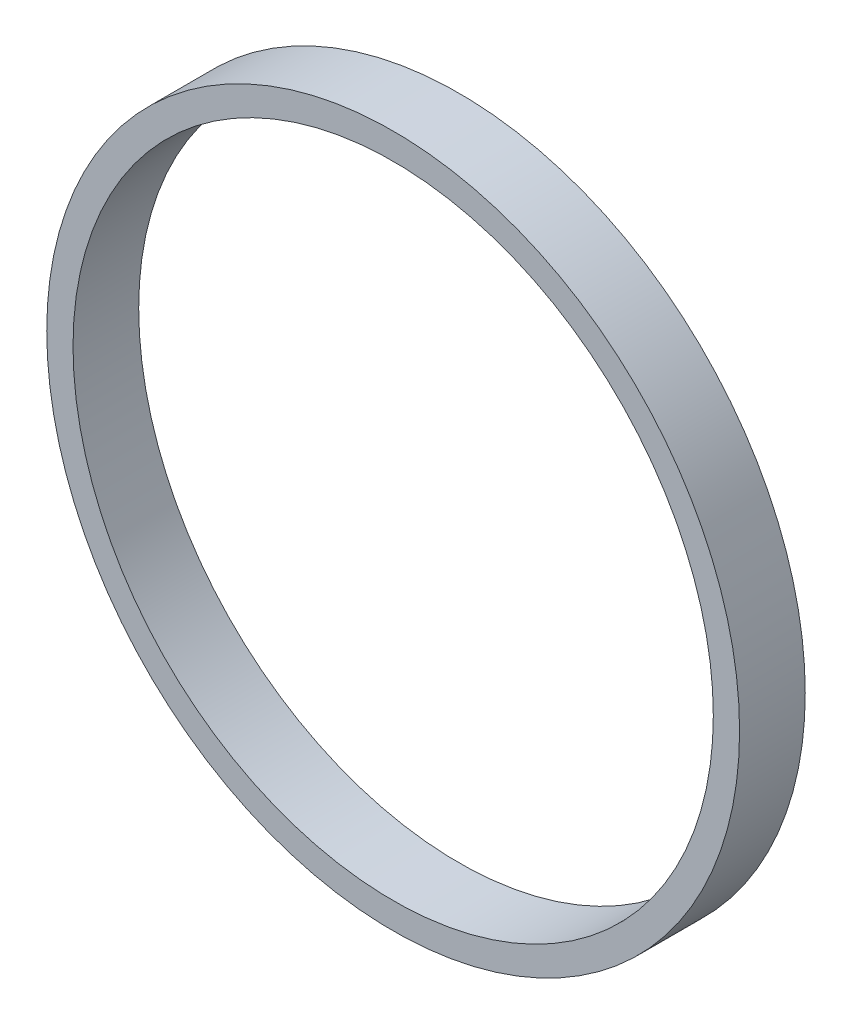
ISO-10303-21;
HEADER;
FILE_DESCRIPTION(('STEP AP214'),'2;1');
FILE_NAME('part.step','',(''),(''),'','','');
FILE_SCHEMA(('AUTOMOTIVE_DESIGN { 1 0 10303 214 1 1 1 1 }'));
ENDSEC;
DATA;
#1=APPLICATION_CONTEXT('core data for automotive mechanical design processes');
#2=APPLICATION_PROTOCOL_DEFINITION('international standard','automotive_design',2000,#1);
#3=PRODUCT_CONTEXT('',#1,'mechanical');
#4=PRODUCT('Part','Part','',(#3));
#5=PRODUCT_RELATED_PRODUCT_CATEGORY('part','',(#4));
#6=PRODUCT_DEFINITION_FORMATION('','',#4);
#7=PRODUCT_DEFINITION_CONTEXT('part definition',#1,'design');
#8=PRODUCT_DEFINITION('design','',#6,#7);
#9=PRODUCT_DEFINITION_SHAPE('','',#8);
#10=(LENGTH_UNIT() NAMED_UNIT(*) SI_UNIT(.MILLI.,.METRE.));
#11=(NAMED_UNIT(*) PLANE_ANGLE_UNIT() SI_UNIT($,.RADIAN.));
#12=(NAMED_UNIT(*) SI_UNIT($,.STERADIAN.) SOLID_ANGLE_UNIT());
#13=UNCERTAINTY_MEASURE_WITH_UNIT(LENGTH_MEASURE(1.E-05),#10,'distance_accuracy_value','');
#14=(GEOMETRIC_REPRESENTATION_CONTEXT(3) GLOBAL_UNCERTAINTY_ASSIGNED_CONTEXT((#13)) GLOBAL_UNIT_ASSIGNED_CONTEXT((#10,
#11,#12)) REPRESENTATION_CONTEXT('',''));
#15=CARTESIAN_POINT('',(0.,0.,0.));
#16=DIRECTION('',(0.,0.,1.));
#17=DIRECTION('',(1.,0.,0.));
#18=AXIS2_PLACEMENT_3D('',#15,#16,#17);
#19=CARTESIAN_POINT('',(0.,0.,10.));
#20=DIRECTION('',(0.,0.,1.));
#21=DIRECTION('',(1.,0.,0.));
#22=AXIS2_PLACEMENT_3D('',#19,#20,#21);
#23=PLANE('',#22);
#24=CARTESIAN_POINT('',(0.,0.,10.));
#25=DIRECTION('',(0.,0.,1.));
#26=DIRECTION('',(1.,0.,0.));
#27=AXIS2_PLACEMENT_3D('',#24,#25,#26);
#28=CIRCLE('',#27,52.75);
#29=CARTESIAN_POINT('',(52.75,0.,10.));
#30=VERTEX_POINT('',#29);
#31=EDGE_CURVE('E11',#30,#30,#28,.T.);
#32=ORIENTED_EDGE('',*,*,#31,.T.);
#33=EDGE_LOOP('',(#32));
#34=FACE_BOUND('',#33,.T.);
#35=CARTESIAN_POINT('',(0.,0.,10.));
#36=DIRECTION('',(0.,0.,1.));
#37=DIRECTION('',(1.,0.,0.));
#38=AXIS2_PLACEMENT_3D('',#35,#36,#37);
#39=CIRCLE('',#38,48.75);
#40=CARTESIAN_POINT('',(48.75,0.,10.));
#41=VERTEX_POINT('',#40);
#42=EDGE_CURVE('E52',#41,#41,#39,.T.);
#43=ORIENTED_EDGE('',*,*,#42,.F.);
#44=EDGE_LOOP('',(#43));
#45=FACE_BOUND('',#44,.T.);
#46=ADVANCED_FACE('F41',(#34,#45),#23,.T.);
#47=CARTESIAN_POINT('',(0.,0.,0.));
#48=DIRECTION('',(0.,0.,1.));
#49=DIRECTION('',(1.,0.,0.));
#50=AXIS2_PLACEMENT_3D('',#47,#48,#49);
#51=PLANE('',#50);
#52=CARTESIAN_POINT('',(0.,0.,0.));
#53=DIRECTION('',(0.,0.,1.));
#54=DIRECTION('',(1.,0.,0.));
#55=AXIS2_PLACEMENT_3D('',#52,#53,#54);
#56=CIRCLE('',#55,52.75);
#57=CARTESIAN_POINT('',(52.75,0.,0.));
#58=VERTEX_POINT('',#57);
#59=EDGE_CURVE('E45',#58,#58,#56,.T.);
#60=ORIENTED_EDGE('',*,*,#59,.F.);
#61=EDGE_LOOP('',(#60));
#62=FACE_BOUND('',#61,.T.);
#63=CARTESIAN_POINT('',(0.,0.,0.));
#64=DIRECTION('',(0.,0.,1.));
#65=DIRECTION('',(1.,0.,0.));
#66=AXIS2_PLACEMENT_3D('',#63,#64,#65);
#67=CIRCLE('',#66,48.75);
#68=CARTESIAN_POINT('',(48.75,0.,0.));
#69=VERTEX_POINT('',#68);
#70=EDGE_CURVE('E54',#69,#69,#67,.T.);
#71=ORIENTED_EDGE('',*,*,#70,.T.);
#72=EDGE_LOOP('',(#71));
#73=FACE_BOUND('',#72,.T.);
#74=ADVANCED_FACE('F64',(#62,#73),#51,.F.);
#75=CARTESIAN_POINT('',(0.,0.,10.));
#76=DIRECTION('',(0.,0.,-1.));
#77=DIRECTION('',(-1.,0.,0.));
#78=AXIS2_PLACEMENT_3D('',#75,#76,#77);
#79=CYLINDRICAL_SURFACE('',#78,52.75);
#80=ORIENTED_EDGE('',*,*,#31,.F.);
#81=EDGE_LOOP('',(#80));
#82=FACE_BOUND('',#81,.T.);
#83=ORIENTED_EDGE('',*,*,#59,.T.);
#84=EDGE_LOOP('',(#83));
#85=FACE_BOUND('',#84,.T.);
#86=ADVANCED_FACE('F43',(#82,#85),#79,.T.);
#87=CARTESIAN_POINT('',(0.,0.,10.));
#88=DIRECTION('',(0.,0.,-1.));
#89=DIRECTION('',(-1.,0.,0.));
#90=AXIS2_PLACEMENT_3D('',#87,#88,#89);
#91=CYLINDRICAL_SURFACE('',#90,48.75);
#92=ORIENTED_EDGE('',*,*,#42,.T.);
#93=EDGE_LOOP('',(#92));
#94=FACE_BOUND('',#93,.T.);
#95=ORIENTED_EDGE('',*,*,#70,.F.);
#96=EDGE_LOOP('',(#95));
#97=FACE_BOUND('',#96,.T.);
#98=ADVANCED_FACE('F60',(#94,#97),#91,.F.);
#99=CLOSED_SHELL('',(#46,#74,#86,#98));
#100=MANIFOLD_SOLID_BREP('B2',#99);
#101=ADVANCED_BREP_SHAPE_REPRESENTATION('',(#18,#100),#14);
#102=SHAPE_DEFINITION_REPRESENTATION(#9,#101);
ENDSEC;
END-ISO-10303-21;
